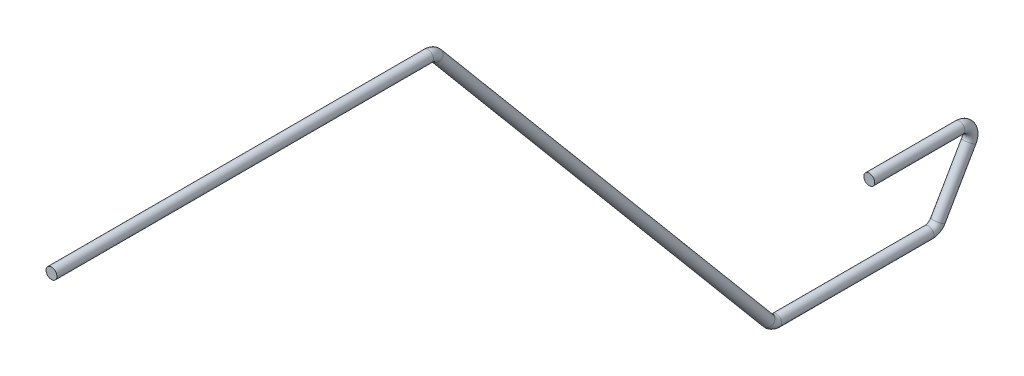
ISO-10303-21;
HEADER;
FILE_DESCRIPTION(('STEP AP214'),'2;1');
FILE_NAME('part.step','',(''),(''),'','','');
FILE_SCHEMA(('AUTOMOTIVE_DESIGN { 1 0 10303 214 1 1 1 1 }'));
ENDSEC;
DATA;
#1=APPLICATION_CONTEXT('core data for automotive mechanical design processes');
#2=APPLICATION_PROTOCOL_DEFINITION('international standard','automotive_design',2000,#1);
#3=PRODUCT_CONTEXT('',#1,'mechanical');
#4=PRODUCT('Part','Part','',(#3));
#5=PRODUCT_RELATED_PRODUCT_CATEGORY('part','',(#4));
#6=PRODUCT_DEFINITION_FORMATION('','',#4);
#7=PRODUCT_DEFINITION_CONTEXT('part definition',#1,'design');
#8=PRODUCT_DEFINITION('design','',#6,#7);
#9=PRODUCT_DEFINITION_SHAPE('','',#8);
#10=(LENGTH_UNIT() NAMED_UNIT(*) SI_UNIT(.MILLI.,.METRE.));
#11=(NAMED_UNIT(*) PLANE_ANGLE_UNIT() SI_UNIT($,.RADIAN.));
#12=(NAMED_UNIT(*) SI_UNIT($,.STERADIAN.) SOLID_ANGLE_UNIT());
#13=UNCERTAINTY_MEASURE_WITH_UNIT(LENGTH_MEASURE(1.E-05),#10,'distance_accuracy_value','');
#14=(GEOMETRIC_REPRESENTATION_CONTEXT(3) GLOBAL_UNCERTAINTY_ASSIGNED_CONTEXT((#13)) GLOBAL_UNIT_ASSIGNED_CONTEXT((#10,
#11,#12)) REPRESENTATION_CONTEXT('',''));
#15=CARTESIAN_POINT('',(0.,0.,0.));
#16=DIRECTION('',(0.,0.,1.));
#17=DIRECTION('',(1.,0.,0.));
#18=AXIS2_PLACEMENT_3D('',#15,#16,#17);
#19=CARTESIAN_POINT('',(0.,0.,0.));
#20=DIRECTION('',(0.,0.,1.));
#21=DIRECTION('',(-1.,0.,0.));
#22=AXIS2_PLACEMENT_3D('',#19,#20,#21);
#23=PLANE('',#22);
#24=CARTESIAN_POINT('',(0.,0.,0.));
#25=DIRECTION('',(0.,0.,1.));
#26=DIRECTION('',(-1.,0.,0.));
#27=AXIS2_PLACEMENT_3D('',#24,#25,#26);
#28=CIRCLE('',#27,0.254);
#29=CARTESIAN_POINT('',(-0.254,0.,0.));
#30=VERTEX_POINT('',#29);
#31=EDGE_CURVE('E92',#30,#30,#28,.T.);
#32=ORIENTED_EDGE('',*,*,#31,.T.);
#33=EDGE_LOOP('',(#32));
#34=FACE_BOUND('',#33,.T.);
#35=ADVANCED_FACE('F49',(#34),#23,.T.);
#36=CARTESIAN_POINT('',(0.,-15.2637182610866,-38.1));
#37=DIRECTION('',(0.,0.,-1.));
#38=DIRECTION('',(-1.,0.,0.));
#39=AXIS2_PLACEMENT_3D('',#36,#37,#38);
#40=PLANE('',#39);
#41=CARTESIAN_POINT('',(0.,-15.2637182610866,-38.1));
#42=DIRECTION('',(0.,0.,-1.));
#43=DIRECTION('',(-1.,0.,0.));
#44=AXIS2_PLACEMENT_3D('',#41,#42,#43);
#45=CIRCLE('',#44,0.254);
#46=CARTESIAN_POINT('',(-0.254,-15.2637182610866,-38.1));
#47=VERTEX_POINT('',#46);
#48=EDGE_CURVE('E11',#47,#47,#45,.T.);
#49=ORIENTED_EDGE('',*,*,#48,.F.);
#50=EDGE_LOOP('',(#49));
#51=FACE_BOUND('',#50,.T.);
#52=ADVANCED_FACE('F101',(#51),#40,.F.);
#53=CARTESIAN_POINT('',(0.,0.,0.));
#54=DIRECTION('',(0.,0.,-1.));
#55=DIRECTION('',(-1.,0.,0.));
#56=AXIS2_PLACEMENT_3D('',#53,#54,#55);
#57=CYLINDRICAL_SURFACE('',#56,0.254);
#58=CARTESIAN_POINT('',(0.,0.,-17.5431157096573));
#59=DIRECTION('',(0.,0.,1.));
#60=DIRECTION('',(-1.,0.,0.));
#61=AXIS2_PLACEMENT_3D('',#58,#59,#60);
#62=CIRCLE('',#61,0.254);
#63=CARTESIAN_POINT('',(0.,0.254,-17.5431157096573));
#64=VERTEX_POINT('',#63);
#65=EDGE_CURVE('E88',#64,#64,#62,.T.);
#66=ORIENTED_EDGE('',*,*,#65,.T.);
#67=EDGE_LOOP('',(#66));
#68=FACE_BOUND('',#67,.T.);
#69=ORIENTED_EDGE('',*,*,#31,.F.);
#70=EDGE_LOOP('',(#69));
#71=FACE_BOUND('',#70,.T.);
#72=ADVANCED_FACE('F98',(#68,#71),#57,.T.);
#73=CARTESIAN_POINT('',(0.,-0.508,-17.5431157096573));
#74=DIRECTION('',(-1.,0.,0.));
#75=DIRECTION('',(0.,0.,1.));
#76=AXIS2_PLACEMENT_3D('',#73,#74,#75);
#77=TOROIDAL_SURFACE('',#76,0.508,0.254);
#78=CARTESIAN_POINT('',(0.,-0.181463894279241,-17.9322662867617));
#79=DIRECTION('',(0.,0.766044443118981,0.642787609686536));
#80=DIRECTION('',(-1.,0.,0.));
#81=AXIS2_PLACEMENT_3D('',#78,#79,#80);
#82=CIRCLE('',#81,0.254);
#83=CARTESIAN_POINT('',(0.,-0.0181958414188602,-18.1268415753139));
#84=VERTEX_POINT('',#83);
#85=EDGE_CURVE('E84',#84,#84,#82,.T.);
#86=CARTESIAN_POINT('',(0.,-0.508,-17.5431157096573));
#87=DIRECTION('',(-1.,0.,0.));
#88=DIRECTION('',(0.,0.,1.));
#89=AXIS2_PLACEMENT_3D('',#86,#87,#88);
#90=CIRCLE('',#89,0.762);
#91=EDGE_CURVE('',#64,#84,#90,.T.);
#92=ORIENTED_EDGE('',*,*,#65,.F.);
#93=ORIENTED_EDGE('',*,*,#85,.T.);
#94=ORIENTED_EDGE('',*,*,#91,.T.);
#95=ORIENTED_EDGE('',*,*,#91,.F.);
#96=EDGE_LOOP('',(#92,#94,#93,#95));
#97=FACE_BOUND('',#96,.T.);
#98=ADVANCED_FACE('F100',(#97),#77,.T.);
#99=CARTESIAN_POINT('',(0.,-0.181463894279241,-17.9322662867617));
#100=DIRECTION('',(0.,-0.766044443118979,-0.642787609686538));
#101=DIRECTION('',(0.,0.642787609686538,-0.766044443118979));
#102=AXIS2_PLACEMENT_3D('',#99,#100,#101);
#103=CYLINDRICAL_SURFACE('',#102,0.254);
#104=CARTESIAN_POINT('',(0.,-18.592593585611,-33.3810384203151));
#105=DIRECTION('',(0.,0.766044443118979,0.642787609686538));
#106=DIRECTION('',(-1.,0.,0.));
#107=AXIS2_PLACEMENT_3D('',#104,#105,#106);
#108=CIRCLE('',#107,0.254);
#109=CARTESIAN_POINT('',(0.,-18.7558616384713,-33.1864631317629));
#110=VERTEX_POINT('',#109);
#111=EDGE_CURVE('E80',#110,#110,#108,.T.);
#112=ORIENTED_EDGE('',*,*,#111,.T.);
#113=EDGE_LOOP('',(#112));
#114=FACE_BOUND('',#113,.T.);
#115=ORIENTED_EDGE('',*,*,#85,.F.);
#116=EDGE_LOOP('',(#115));
#117=FACE_BOUND('',#116,.T.);
#118=ADVANCED_FACE('F108',(#114,#117),#103,.T.);
#119=CARTESIAN_POINT('',(0.,-18.2660574798902,-33.7701889974196));
#120=DIRECTION('',(1.,0.,0.));
#121=DIRECTION('',(0.,0.,-1.));
#122=AXIS2_PLACEMENT_3D('',#119,#120,#121);
#123=TOROIDAL_SURFACE('',#122,0.508000000000003,0.254);
#124=CARTESIAN_POINT('',(0.,-18.7740574798902,-33.7701889974196));
#125=DIRECTION('',(0.,0.,1.));
#126=DIRECTION('',(-1.,0.,0.));
#127=AXIS2_PLACEMENT_3D('',#124,#125,#126);
#128=CIRCLE('',#127,0.254);
#129=CARTESIAN_POINT('',(0.,-19.0280574798902,-33.7701889974196));
#130=VERTEX_POINT('',#129);
#131=EDGE_CURVE('E76',#130,#130,#128,.T.);
#132=CARTESIAN_POINT('',(0.,-18.2660574798902,-33.7701889974196));
#133=DIRECTION('',(1.,0.,0.));
#134=DIRECTION('',(0.,0.,-1.));
#135=AXIS2_PLACEMENT_3D('',#132,#133,#134);
#136=CIRCLE('',#135,0.762000000000003);
#137=EDGE_CURVE('',#110,#130,#136,.T.);
#138=ORIENTED_EDGE('',*,*,#111,.F.);
#139=ORIENTED_EDGE('',*,*,#131,.T.);
#140=ORIENTED_EDGE('',*,*,#137,.T.);
#141=ORIENTED_EDGE('',*,*,#137,.F.);
#142=EDGE_LOOP('',(#138,#140,#139,#141));
#143=FACE_BOUND('',#142,.T.);
#144=ADVANCED_FACE('F133',(#143),#123,.T.);
#145=CARTESIAN_POINT('',(0.,-18.7740574798902,-33.7701889974196));
#146=DIRECTION('',(0.,0.,-1.));
#147=DIRECTION('',(0.,1.,0.));
#148=AXIS2_PLACEMENT_3D('',#145,#146,#147);
#149=CYLINDRICAL_SURFACE('',#148,0.254);
#150=CARTESIAN_POINT('',(0.,-18.7740574798902,-40.8600107703285));
#151=DIRECTION('',(0.,0.,1.));
#152=DIRECTION('',(-1.,0.,0.));
#153=AXIS2_PLACEMENT_3D('',#150,#151,#152);
#154=CIRCLE('',#153,0.254);
#155=CARTESIAN_POINT('',(0.,-19.0280574798902,-40.8600107703285));
#156=VERTEX_POINT('',#155);
#157=EDGE_CURVE('E72',#156,#156,#154,.T.);
#158=ORIENTED_EDGE('',*,*,#157,.T.);
#159=EDGE_LOOP('',(#158));
#160=FACE_BOUND('',#159,.T.);
#161=ORIENTED_EDGE('',*,*,#131,.F.);
#162=EDGE_LOOP('',(#161));
#163=FACE_BOUND('',#162,.T.);
#164=ADVANCED_FACE('F129',(#160,#163),#149,.T.);
#165=CARTESIAN_POINT('',(0.,-18.2660574798902,-40.8600107703285));
#166=DIRECTION('',(1.,0.,0.));
#167=DIRECTION('',(0.,0.,-1.));
#168=AXIS2_PLACEMENT_3D('',#165,#166,#167);
#169=TOROIDAL_SURFACE('',#168,0.508000000000002,0.254);
#170=CARTESIAN_POINT('',(0.,-18.5200574798902,-41.299951675451));
#171=DIRECTION('',(0.,-0.866025403784436,0.500000000000004));
#172=DIRECTION('',(-1.,0.,0.));
#173=AXIS2_PLACEMENT_3D('',#170,#171,#172);
#174=CIRCLE('',#173,0.254);
#175=CARTESIAN_POINT('',(0.,-18.6470574798902,-41.5199221280123));
#176=VERTEX_POINT('',#175);
#177=EDGE_CURVE('E66',#176,#176,#174,.T.);
#178=CARTESIAN_POINT('',(0.,-18.2660574798902,-40.8600107703285));
#179=DIRECTION('',(1.,0.,0.));
#180=DIRECTION('',(0.,0.,-1.));
#181=AXIS2_PLACEMENT_3D('',#178,#179,#180);
#182=CIRCLE('',#181,0.762000000000001);
#183=EDGE_CURVE('',#156,#176,#182,.T.);
#184=ORIENTED_EDGE('',*,*,#157,.F.);
#185=ORIENTED_EDGE('',*,*,#177,.T.);
#186=ORIENTED_EDGE('',*,*,#183,.T.);
#187=ORIENTED_EDGE('',*,*,#183,.F.);
#188=EDGE_LOOP('',(#184,#186,#185,#187));
#189=FACE_BOUND('',#188,.T.);
#190=ADVANCED_FACE('F125',(#189),#169,.T.);
#191=CARTESIAN_POINT('',(0.,-18.5200574798902,-41.299951675451));
#192=DIRECTION('',(0.,0.86602540378444,-0.499999999999997));
#193=DIRECTION('',(0.,0.499999999999997,0.86602540378444));
#194=AXIS2_PLACEMENT_3D('',#191,#192,#193);
#195=CYLINDRICAL_SURFACE('',#194,0.254);
#196=CARTESIAN_POINT('',(0.,-16.0257182610866,-42.7400590948775));
#197=DIRECTION('',(0.,-0.86602540378444,0.499999999999997));
#198=DIRECTION('',(-1.,0.,0.));
#199=AXIS2_PLACEMENT_3D('',#196,#197,#198);
#200=CIRCLE('',#199,0.254);
#201=CARTESIAN_POINT('',(0.,-16.1527182610866,-42.9600295474388));
#202=VERTEX_POINT('',#201);
#203=EDGE_CURVE('E61',#202,#202,#200,.T.);
#204=ORIENTED_EDGE('',*,*,#203,.T.);
#205=EDGE_LOOP('',(#204));
#206=FACE_BOUND('',#205,.T.);
#207=ORIENTED_EDGE('',*,*,#177,.F.);
#208=EDGE_LOOP('',(#207));
#209=FACE_BOUND('',#208,.T.);
#210=ADVANCED_FACE('F119',(#206,#209),#195,.T.);
#211=CARTESIAN_POINT('',(0.,-15.7717182610866,-42.300118189755));
#212=DIRECTION('',(1.,0.,0.));
#213=DIRECTION('',(0.,0.,-1.));
#214=AXIS2_PLACEMENT_3D('',#211,#212,#213);
#215=TOROIDAL_SURFACE('',#214,0.508000000000004,0.254);
#216=CARTESIAN_POINT('',(0.,-15.2637182610861,-42.3001181897552));
#217=DIRECTION('',(0.,0.,-1.));
#218=DIRECTION('',(-1.,0.,0.));
#219=AXIS2_PLACEMENT_3D('',#216,#217,#218);
#220=CIRCLE('',#219,0.254);
#221=CARTESIAN_POINT('',(0.,-15.0097182610866,-42.3001181897553));
#222=VERTEX_POINT('',#221);
#223=EDGE_CURVE('E56',#222,#222,#220,.T.);
#224=CARTESIAN_POINT('',(0.,-15.7717182610866,-42.300118189755));
#225=DIRECTION('',(1.,0.,0.));
#226=DIRECTION('',(0.,0.,-1.));
#227=AXIS2_PLACEMENT_3D('',#224,#225,#226);
#228=CIRCLE('',#227,0.762000000000004);
#229=EDGE_CURVE('',#202,#222,#228,.T.);
#230=ORIENTED_EDGE('',*,*,#203,.F.);
#231=ORIENTED_EDGE('',*,*,#223,.T.);
#232=ORIENTED_EDGE('',*,*,#229,.T.);
#233=ORIENTED_EDGE('',*,*,#229,.F.);
#234=EDGE_LOOP('',(#230,#232,#231,#233));
#235=FACE_BOUND('',#234,.T.);
#236=ADVANCED_FACE('F114',(#235),#215,.T.);
#237=CARTESIAN_POINT('',(0.,-15.2637182610866,-42.300118189755));
#238=DIRECTION('',(0.,0.,1.));
#239=DIRECTION('',(1.,0.,0.));
#240=AXIS2_PLACEMENT_3D('',#237,#238,#239);
#241=CYLINDRICAL_SURFACE('',#240,0.254);
#242=ORIENTED_EDGE('',*,*,#48,.T.);
#243=EDGE_LOOP('',(#242));
#244=FACE_BOUND('',#243,.T.);
#245=ORIENTED_EDGE('',*,*,#223,.F.);
#246=EDGE_LOOP('',(#245));
#247=FACE_BOUND('',#246,.T.);
#248=ADVANCED_FACE('F112',(#244,#247),#241,.T.);
#249=CLOSED_SHELL('',(#35,#52,#72,#98,#118,#144,#164,#190,#210,#236,#248));
#250=MANIFOLD_SOLID_BREP('B2',#249);
#251=ADVANCED_BREP_SHAPE_REPRESENTATION('',(#18,#250),#14);
#252=SHAPE_DEFINITION_REPRESENTATION(#9,#251);
ENDSEC;
END-ISO-10303-21;
